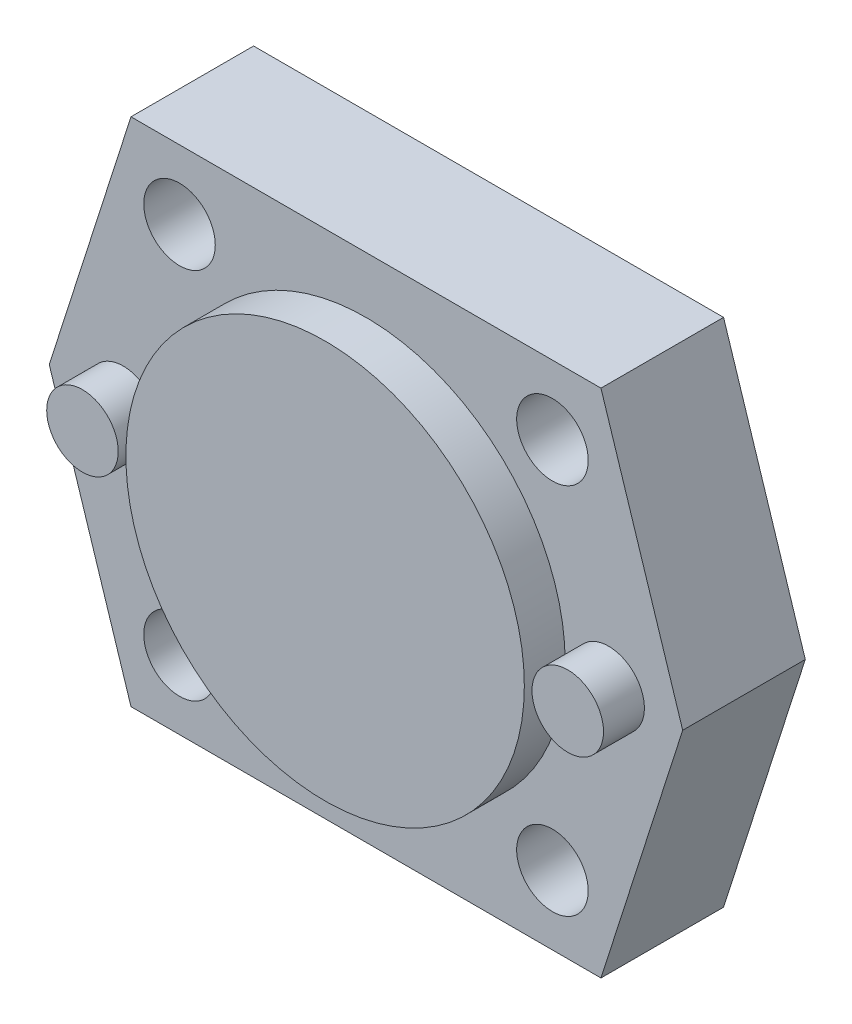
ISO-10303-21;
HEADER;
FILE_DESCRIPTION(('STEP AP214'),'2;1');
FILE_NAME('part.step','',(''),(''),'','','');
FILE_SCHEMA(('AUTOMOTIVE_DESIGN { 1 0 10303 214 1 1 1 1 }'));
ENDSEC;
DATA;
#1=APPLICATION_CONTEXT('core data for automotive mechanical design processes');
#2=APPLICATION_PROTOCOL_DEFINITION('international standard','automotive_design',2000,#1);
#3=PRODUCT_CONTEXT('',#1,'mechanical');
#4=PRODUCT('Part','Part','',(#3));
#5=PRODUCT_RELATED_PRODUCT_CATEGORY('part','',(#4));
#6=PRODUCT_DEFINITION_FORMATION('','',#4);
#7=PRODUCT_DEFINITION_CONTEXT('part definition',#1,'design');
#8=PRODUCT_DEFINITION('design','',#6,#7);
#9=PRODUCT_DEFINITION_SHAPE('','',#8);
#10=(LENGTH_UNIT() NAMED_UNIT(*) SI_UNIT(.MILLI.,.METRE.));
#11=(NAMED_UNIT(*) PLANE_ANGLE_UNIT() SI_UNIT($,.RADIAN.));
#12=(NAMED_UNIT(*) SI_UNIT($,.STERADIAN.) SOLID_ANGLE_UNIT());
#13=UNCERTAINTY_MEASURE_WITH_UNIT(LENGTH_MEASURE(1.E-05),#10,'distance_accuracy_value','');
#14=(GEOMETRIC_REPRESENTATION_CONTEXT(3) GLOBAL_UNCERTAINTY_ASSIGNED_CONTEXT((#13)) GLOBAL_UNIT_ASSIGNED_CONTEXT((#10,
#11,#12)) REPRESENTATION_CONTEXT('',''));
#15=CARTESIAN_POINT('',(0.,0.,0.));
#16=DIRECTION('',(0.,0.,1.));
#17=DIRECTION('',(1.,0.,0.));
#18=AXIS2_PLACEMENT_3D('',#15,#16,#17);
#19=CARTESIAN_POINT('',(-31.,0.,12.));
#20=DIRECTION('',(0.952424147199324,-0.304775727103784,0.));
#21=DIRECTION('',(0.304775727103784,0.952424147199324,0.));
#22=AXIS2_PLACEMENT_3D('',#19,#20,#21);
#23=PLANE('',#22);
#24=DIRECTION('',(-0.304775727103784,-0.952424147199324,0.));
#25=VECTOR('',#24,1.);
#26=CARTESIAN_POINT('',(-31.,0.,0.));
#27=LINE('',#26,#25);
#28=CARTESIAN_POINT('',(-23.,25.,0.));
#29=VERTEX_POINT('',#28);
#30=CARTESIAN_POINT('',(-31.,0.,0.));
#31=VERTEX_POINT('',#30);
#32=EDGE_CURVE('E120',#29,#31,#27,.T.);
#33=ORIENTED_EDGE('',*,*,#32,.T.);
#34=DIRECTION('',(0.,0.,-1.));
#35=VECTOR('',#34,1.);
#36=CARTESIAN_POINT('',(-31.,0.,12.));
#37=LINE('',#36,#35);
#38=CARTESIAN_POINT('',(-31.,0.,12.));
#39=VERTEX_POINT('',#38);
#40=EDGE_CURVE('E138',#39,#31,#37,.T.);
#41=ORIENTED_EDGE('',*,*,#40,.F.);
#42=DIRECTION('',(-0.304775727103784,-0.952424147199324,0.));
#43=VECTOR('',#42,1.);
#44=CARTESIAN_POINT('',(-31.,0.,12.));
#45=LINE('',#44,#43);
#46=CARTESIAN_POINT('',(-23.,25.,12.));
#47=VERTEX_POINT('',#46);
#48=EDGE_CURVE('E131',#47,#39,#45,.T.);
#49=ORIENTED_EDGE('',*,*,#48,.F.);
#50=DIRECTION('',(0.,0.,-1.));
#51=VECTOR('',#50,1.);
#52=CARTESIAN_POINT('',(-23.,25.,12.));
#53=LINE('',#52,#51);
#54=EDGE_CURVE('E116',#47,#29,#53,.T.);
#55=ORIENTED_EDGE('',*,*,#54,.T.);
#56=EDGE_LOOP('',(#33,#41,#49,#55));
#57=FACE_BOUND('',#56,.T.);
#58=ADVANCED_FACE('F35',(#57),#23,.F.);
#59=CARTESIAN_POINT('',(-23.,-25.,12.));
#60=DIRECTION('',(0.952424147199324,0.304775727103784,0.));
#61=DIRECTION('',(-0.304775727103784,0.952424147199324,0.));
#62=AXIS2_PLACEMENT_3D('',#59,#60,#61);
#63=PLANE('',#62);
#64=DIRECTION('',(0.304775727103784,-0.952424147199324,0.));
#65=VECTOR('',#64,1.);
#66=CARTESIAN_POINT('',(-23.,-25.,0.));
#67=LINE('',#66,#65);
#68=CARTESIAN_POINT('',(-23.,-25.,0.));
#69=VERTEX_POINT('',#68);
#70=EDGE_CURVE('E123',#31,#69,#67,.T.);
#71=ORIENTED_EDGE('',*,*,#70,.T.);
#72=DIRECTION('',(0.,0.,-1.));
#73=VECTOR('',#72,1.);
#74=CARTESIAN_POINT('',(-23.,-25.,12.));
#75=LINE('',#74,#73);
#76=CARTESIAN_POINT('',(-23.,-25.,12.));
#77=VERTEX_POINT('',#76);
#78=EDGE_CURVE('E135',#77,#69,#75,.T.);
#79=ORIENTED_EDGE('',*,*,#78,.F.);
#80=DIRECTION('',(0.304775727103784,-0.952424147199324,0.));
#81=VECTOR('',#80,1.);
#82=CARTESIAN_POINT('',(-23.,-25.,12.));
#83=LINE('',#82,#81);
#84=EDGE_CURVE('E89',#39,#77,#83,.T.);
#85=ORIENTED_EDGE('',*,*,#84,.F.);
#86=ORIENTED_EDGE('',*,*,#40,.T.);
#87=EDGE_LOOP('',(#71,#79,#85,#86));
#88=FACE_BOUND('',#87,.T.);
#89=ADVANCED_FACE('F153',(#88),#63,.F.);
#90=CARTESIAN_POINT('',(23.,-25.,12.));
#91=DIRECTION('',(0.,1.,0.));
#92=DIRECTION('',(0.,0.,1.));
#93=AXIS2_PLACEMENT_3D('',#90,#91,#92);
#94=PLANE('',#93);
#95=DIRECTION('',(1.,0.,0.));
#96=VECTOR('',#95,1.);
#97=CARTESIAN_POINT('',(23.,-25.,0.));
#98=LINE('',#97,#96);
#99=CARTESIAN_POINT('',(23.,-25.,0.));
#100=VERTEX_POINT('',#99);
#101=EDGE_CURVE('E126',#69,#100,#98,.T.);
#102=ORIENTED_EDGE('',*,*,#101,.T.);
#103=DIRECTION('',(0.,0.,-1.));
#104=VECTOR('',#103,1.);
#105=CARTESIAN_POINT('',(23.,-25.,12.));
#106=LINE('',#105,#104);
#107=CARTESIAN_POINT('',(23.,-25.,12.));
#108=VERTEX_POINT('',#107);
#109=EDGE_CURVE('E111',#108,#100,#106,.T.);
#110=ORIENTED_EDGE('',*,*,#109,.F.);
#111=DIRECTION('',(1.,0.,0.));
#112=VECTOR('',#111,1.);
#113=CARTESIAN_POINT('',(23.,-25.,12.));
#114=LINE('',#113,#112);
#115=EDGE_CURVE('E102',#77,#108,#114,.T.);
#116=ORIENTED_EDGE('',*,*,#115,.F.);
#117=ORIENTED_EDGE('',*,*,#78,.T.);
#118=EDGE_LOOP('',(#102,#110,#116,#117));
#119=FACE_BOUND('',#118,.T.);
#120=ADVANCED_FACE('F156',(#119),#94,.F.);
#121=CARTESIAN_POINT('',(31.,0.,12.));
#122=DIRECTION('',(-0.952424147199324,0.304775727103784,0.));
#123=DIRECTION('',(-0.304775727103784,-0.952424147199324,0.));
#124=AXIS2_PLACEMENT_3D('',#121,#122,#123);
#125=PLANE('',#124);
#126=DIRECTION('',(0.304775727103784,0.952424147199324,0.));
#127=VECTOR('',#126,1.);
#128=CARTESIAN_POINT('',(31.,0.,0.));
#129=LINE('',#128,#127);
#130=CARTESIAN_POINT('',(31.,0.,0.));
#131=VERTEX_POINT('',#130);
#132=EDGE_CURVE('E110',#100,#131,#129,.T.);
#133=ORIENTED_EDGE('',*,*,#132,.T.);
#134=DIRECTION('',(0.,0.,-1.));
#135=VECTOR('',#134,1.);
#136=CARTESIAN_POINT('',(31.,0.,12.));
#137=LINE('',#136,#135);
#138=CARTESIAN_POINT('',(31.,0.,12.));
#139=VERTEX_POINT('',#138);
#140=EDGE_CURVE('E107',#139,#131,#137,.T.);
#141=ORIENTED_EDGE('',*,*,#140,.F.);
#142=DIRECTION('',(0.304775727103784,0.952424147199324,0.));
#143=VECTOR('',#142,1.);
#144=CARTESIAN_POINT('',(31.,0.,12.));
#145=LINE('',#144,#143);
#146=EDGE_CURVE('E96',#108,#139,#145,.T.);
#147=ORIENTED_EDGE('',*,*,#146,.F.);
#148=ORIENTED_EDGE('',*,*,#109,.T.);
#149=EDGE_LOOP('',(#133,#141,#147,#148));
#150=FACE_BOUND('',#149,.T.);
#151=ADVANCED_FACE('F108',(#150),#125,.F.);
#152=CARTESIAN_POINT('',(23.,25.,12.));
#153=DIRECTION('',(-0.952424147199324,-0.304775727103784,0.));
#154=DIRECTION('',(0.304775727103784,-0.952424147199324,0.));
#155=AXIS2_PLACEMENT_3D('',#152,#153,#154);
#156=PLANE('',#155);
#157=DIRECTION('',(-0.304775727103784,0.952424147199324,0.));
#158=VECTOR('',#157,1.);
#159=CARTESIAN_POINT('',(23.,25.,0.));
#160=LINE('',#159,#158);
#161=CARTESIAN_POINT('',(23.,25.,0.));
#162=VERTEX_POINT('',#161);
#163=EDGE_CURVE('E74',#131,#162,#160,.T.);
#164=ORIENTED_EDGE('',*,*,#163,.T.);
#165=DIRECTION('',(0.,0.,-1.));
#166=VECTOR('',#165,1.);
#167=CARTESIAN_POINT('',(23.,25.,12.));
#168=LINE('',#167,#166);
#169=CARTESIAN_POINT('',(23.,25.,12.));
#170=VERTEX_POINT('',#169);
#171=EDGE_CURVE('E112',#170,#162,#168,.T.);
#172=ORIENTED_EDGE('',*,*,#171,.F.);
#173=DIRECTION('',(-0.304775727103784,0.952424147199324,0.));
#174=VECTOR('',#173,1.);
#175=CARTESIAN_POINT('',(23.,25.,12.));
#176=LINE('',#175,#174);
#177=EDGE_CURVE('E100',#139,#170,#176,.T.);
#178=ORIENTED_EDGE('',*,*,#177,.F.);
#179=ORIENTED_EDGE('',*,*,#140,.T.);
#180=EDGE_LOOP('',(#164,#172,#178,#179));
#181=FACE_BOUND('',#180,.T.);
#182=ADVANCED_FACE('F114',(#181),#156,.F.);
#183=CARTESIAN_POINT('',(-23.,25.,12.));
#184=DIRECTION('',(0.,-1.,0.));
#185=DIRECTION('',(0.,0.,-1.));
#186=AXIS2_PLACEMENT_3D('',#183,#184,#185);
#187=PLANE('',#186);
#188=DIRECTION('',(-1.,0.,0.));
#189=VECTOR('',#188,1.);
#190=CARTESIAN_POINT('',(-23.,25.,0.));
#191=LINE('',#190,#189);
#192=EDGE_CURVE('E80',#162,#29,#191,.T.);
#193=ORIENTED_EDGE('',*,*,#192,.T.);
#194=ORIENTED_EDGE('',*,*,#54,.F.);
#195=DIRECTION('',(-1.,0.,0.));
#196=VECTOR('',#195,1.);
#197=CARTESIAN_POINT('',(-23.,25.,12.));
#198=LINE('',#197,#196);
#199=EDGE_CURVE('E51',#170,#47,#198,.T.);
#200=ORIENTED_EDGE('',*,*,#199,.F.);
#201=ORIENTED_EDGE('',*,*,#171,.T.);
#202=EDGE_LOOP('',(#193,#194,#200,#201));
#203=FACE_BOUND('',#202,.T.);
#204=ADVANCED_FACE('F161',(#203),#187,.F.);
#205=CARTESIAN_POINT('',(0.,0.,12.));
#206=DIRECTION('',(0.,0.,-1.));
#207=DIRECTION('',(-1.,0.,0.));
#208=AXIS2_PLACEMENT_3D('',#205,#206,#207);
#209=PLANE('',#208);
#210=CARTESIAN_POINT('',(-18.25,18.25,12.));
#211=DIRECTION('',(0.,0.,1.));
#212=DIRECTION('',(1.,0.,0.));
#213=AXIS2_PLACEMENT_3D('',#210,#211,#212);
#214=CIRCLE('',#213,3.5);
#215=CARTESIAN_POINT('',(-14.75,18.25,12.));
#216=VERTEX_POINT('',#215);
#217=EDGE_CURVE('E318',#216,#216,#214,.T.);
#218=ORIENTED_EDGE('',*,*,#217,.F.);
#219=EDGE_LOOP('',(#218));
#220=FACE_BOUND('',#219,.T.);
#221=CARTESIAN_POINT('',(-18.25,-18.25,12.));
#222=DIRECTION('',(0.,0.,1.));
#223=DIRECTION('',(1.,0.,0.));
#224=AXIS2_PLACEMENT_3D('',#221,#222,#223);
#225=CIRCLE('',#224,3.5);
#226=CARTESIAN_POINT('',(-14.75,-18.25,12.));
#227=VERTEX_POINT('',#226);
#228=EDGE_CURVE('E320',#227,#227,#225,.T.);
#229=ORIENTED_EDGE('',*,*,#228,.F.);
#230=EDGE_LOOP('',(#229));
#231=FACE_BOUND('',#230,.T.);
#232=CARTESIAN_POINT('',(18.25,-18.25,12.));
#233=DIRECTION('',(0.,0.,1.));
#234=DIRECTION('',(1.,0.,0.));
#235=AXIS2_PLACEMENT_3D('',#232,#233,#234);
#236=CIRCLE('',#235,3.5);
#237=CARTESIAN_POINT('',(21.75,-18.25,12.));
#238=VERTEX_POINT('',#237);
#239=EDGE_CURVE('E347',#238,#238,#236,.T.);
#240=ORIENTED_EDGE('',*,*,#239,.F.);
#241=EDGE_LOOP('',(#240));
#242=FACE_BOUND('',#241,.T.);
#243=CARTESIAN_POINT('',(18.25,18.25,12.));
#244=DIRECTION('',(0.,0.,1.));
#245=DIRECTION('',(1.,0.,0.));
#246=AXIS2_PLACEMENT_3D('',#243,#244,#245);
#247=CIRCLE('',#246,3.5);
#248=CARTESIAN_POINT('',(21.75,18.25,12.));
#249=VERTEX_POINT('',#248);
#250=EDGE_CURVE('E328',#249,#249,#247,.T.);
#251=ORIENTED_EDGE('',*,*,#250,.F.);
#252=EDGE_LOOP('',(#251));
#253=FACE_BOUND('',#252,.T.);
#254=CARTESIAN_POINT('',(-23.75,0.,12.));
#255=DIRECTION('',(0.,0.,-1.));
#256=DIRECTION('',(-1.,0.,0.));
#257=AXIS2_PLACEMENT_3D('',#254,#255,#256);
#258=CIRCLE('',#257,3.5);
#259=CARTESIAN_POINT('',(-27.25,0.,12.));
#260=VERTEX_POINT('',#259);
#261=EDGE_CURVE('E11',#260,#260,#258,.F.);
#262=ORIENTED_EDGE('',*,*,#261,.F.);
#263=EDGE_LOOP('',(#262));
#264=FACE_BOUND('',#263,.T.);
#265=CARTESIAN_POINT('',(23.75,0.,12.));
#266=DIRECTION('',(0.,0.,-1.));
#267=DIRECTION('',(-1.,0.,0.));
#268=AXIS2_PLACEMENT_3D('',#265,#266,#267);
#269=CIRCLE('',#268,3.5);
#270=CARTESIAN_POINT('',(20.25,0.,12.));
#271=VERTEX_POINT('',#270);
#272=EDGE_CURVE('E43',#271,#271,#269,.F.);
#273=ORIENTED_EDGE('',*,*,#272,.F.);
#274=EDGE_LOOP('',(#273));
#275=FACE_BOUND('',#274,.T.);
#276=CARTESIAN_POINT('',(0.,0.,12.));
#277=DIRECTION('',(0.,0.,1.));
#278=DIRECTION('',(1.,0.,0.));
#279=AXIS2_PLACEMENT_3D('',#276,#277,#278);
#280=CIRCLE('',#279,19.5);
#281=CARTESIAN_POINT('',(19.5,0.,12.));
#282=VERTEX_POINT('',#281);
#283=EDGE_CURVE('E139',#282,#282,#280,.T.);
#284=ORIENTED_EDGE('',*,*,#283,.F.);
#285=EDGE_LOOP('',(#284));
#286=FACE_BOUND('',#285,.T.);
#287=ORIENTED_EDGE('',*,*,#48,.T.);
#288=ORIENTED_EDGE('',*,*,#84,.T.);
#289=ORIENTED_EDGE('',*,*,#115,.T.);
#290=ORIENTED_EDGE('',*,*,#146,.T.);
#291=ORIENTED_EDGE('',*,*,#177,.T.);
#292=ORIENTED_EDGE('',*,*,#199,.T.);
#293=EDGE_LOOP('',(#287,#288,#289,#290,#291,#292));
#294=FACE_BOUND('',#293,.T.);
#295=ADVANCED_FACE('F98',(#220,#231,#242,#253,#264,#275,#286,#294),#209,.F.);
#296=CARTESIAN_POINT('',(0.,0.,0.));
#297=DIRECTION('',(0.,0.,-1.));
#298=DIRECTION('',(-1.,0.,0.));
#299=AXIS2_PLACEMENT_3D('',#296,#297,#298);
#300=PLANE('',#299);
#301=CARTESIAN_POINT('',(-18.25,18.25,0.));
#302=DIRECTION('',(0.,0.,1.));
#303=DIRECTION('',(1.,0.,0.));
#304=AXIS2_PLACEMENT_3D('',#301,#302,#303);
#305=CIRCLE('',#304,3.5);
#306=CARTESIAN_POINT('',(-14.75,18.25,0.));
#307=VERTEX_POINT('',#306);
#308=EDGE_CURVE('E315',#307,#307,#305,.T.);
#309=ORIENTED_EDGE('',*,*,#308,.T.);
#310=EDGE_LOOP('',(#309));
#311=FACE_BOUND('',#310,.T.);
#312=CARTESIAN_POINT('',(-18.25,-18.25,0.));
#313=DIRECTION('',(0.,0.,1.));
#314=DIRECTION('',(1.,0.,0.));
#315=AXIS2_PLACEMENT_3D('',#312,#313,#314);
#316=CIRCLE('',#315,3.5);
#317=CARTESIAN_POINT('',(-14.75,-18.25,0.));
#318=VERTEX_POINT('',#317);
#319=EDGE_CURVE('E352',#318,#318,#316,.T.);
#320=ORIENTED_EDGE('',*,*,#319,.T.);
#321=EDGE_LOOP('',(#320));
#322=FACE_BOUND('',#321,.T.);
#323=CARTESIAN_POINT('',(18.25,-18.25,0.));
#324=DIRECTION('',(0.,0.,1.));
#325=DIRECTION('',(1.,0.,0.));
#326=AXIS2_PLACEMENT_3D('',#323,#324,#325);
#327=CIRCLE('',#326,3.5);
#328=CARTESIAN_POINT('',(21.75,-18.25,0.));
#329=VERTEX_POINT('',#328);
#330=EDGE_CURVE('E331',#329,#329,#327,.T.);
#331=ORIENTED_EDGE('',*,*,#330,.T.);
#332=EDGE_LOOP('',(#331));
#333=FACE_BOUND('',#332,.T.);
#334=CARTESIAN_POINT('',(18.25,18.25,0.));
#335=DIRECTION('',(0.,0.,1.));
#336=DIRECTION('',(1.,0.,0.));
#337=AXIS2_PLACEMENT_3D('',#334,#335,#336);
#338=CIRCLE('',#337,3.5);
#339=CARTESIAN_POINT('',(21.75,18.25,0.));
#340=VERTEX_POINT('',#339);
#341=EDGE_CURVE('E324',#340,#340,#338,.T.);
#342=ORIENTED_EDGE('',*,*,#341,.T.);
#343=EDGE_LOOP('',(#342));
#344=FACE_BOUND('',#343,.T.);
#345=ORIENTED_EDGE('',*,*,#32,.F.);
#346=ORIENTED_EDGE('',*,*,#192,.F.);
#347=ORIENTED_EDGE('',*,*,#163,.F.);
#348=ORIENTED_EDGE('',*,*,#132,.F.);
#349=ORIENTED_EDGE('',*,*,#101,.F.);
#350=ORIENTED_EDGE('',*,*,#70,.F.);
#351=EDGE_LOOP('',(#345,#346,#347,#348,#349,#350));
#352=FACE_BOUND('',#351,.T.);
#353=ADVANCED_FACE('F159',(#311,#322,#333,#344,#352),#300,.T.);
#354=CARTESIAN_POINT('',(0.,0.,16.));
#355=DIRECTION('',(0.,0.,-1.));
#356=DIRECTION('',(-1.,0.,0.));
#357=AXIS2_PLACEMENT_3D('',#354,#355,#356);
#358=CYLINDRICAL_SURFACE('',#357,19.5);
#359=CARTESIAN_POINT('',(0.,0.,16.));
#360=DIRECTION('',(0.,0.,1.));
#361=DIRECTION('',(1.,0.,0.));
#362=AXIS2_PLACEMENT_3D('',#359,#360,#361);
#363=CIRCLE('',#362,19.5);
#364=CARTESIAN_POINT('',(19.5,0.,16.));
#365=VERTEX_POINT('',#364);
#366=EDGE_CURVE('E124',#365,#365,#363,.T.);
#367=ORIENTED_EDGE('',*,*,#366,.F.);
#368=EDGE_LOOP('',(#367));
#369=FACE_BOUND('',#368,.T.);
#370=ORIENTED_EDGE('',*,*,#283,.T.);
#371=EDGE_LOOP('',(#370));
#372=FACE_BOUND('',#371,.T.);
#373=ADVANCED_FACE('F200',(#369,#372),#358,.T.);
#374=CARTESIAN_POINT('',(0.,0.,16.));
#375=DIRECTION('',(0.,0.,1.));
#376=DIRECTION('',(1.,0.,0.));
#377=AXIS2_PLACEMENT_3D('',#374,#375,#376);
#378=PLANE('',#377);
#379=ORIENTED_EDGE('',*,*,#366,.T.);
#380=EDGE_LOOP('',(#379));
#381=FACE_BOUND('',#380,.T.);
#382=ADVANCED_FACE('F205',(#381),#378,.T.);
#383=CARTESIAN_POINT('',(23.75,0.,16.));
#384=DIRECTION('',(0.,0.,-1.));
#385=DIRECTION('',(-1.,0.,0.));
#386=AXIS2_PLACEMENT_3D('',#383,#384,#385);
#387=CYLINDRICAL_SURFACE('',#386,3.5);
#388=CARTESIAN_POINT('',(23.75,0.,16.));
#389=DIRECTION('',(0.,0.,1.));
#390=DIRECTION('',(1.,0.,0.));
#391=AXIS2_PLACEMENT_3D('',#388,#389,#390);
#392=CIRCLE('',#391,3.5);
#393=CARTESIAN_POINT('',(27.25,0.,16.));
#394=VERTEX_POINT('',#393);
#395=EDGE_CURVE('E333',#394,#394,#392,.T.);
#396=ORIENTED_EDGE('',*,*,#395,.F.);
#397=EDGE_LOOP('',(#396));
#398=FACE_BOUND('',#397,.T.);
#399=ORIENTED_EDGE('',*,*,#272,.T.);
#400=EDGE_LOOP('',(#399));
#401=FACE_BOUND('',#400,.T.);
#402=ADVANCED_FACE('F217',(#398,#401),#387,.T.);
#403=CARTESIAN_POINT('',(23.75,0.,16.));
#404=DIRECTION('',(0.,0.,1.));
#405=DIRECTION('',(1.,0.,0.));
#406=AXIS2_PLACEMENT_3D('',#403,#404,#405);
#407=PLANE('',#406);
#408=ORIENTED_EDGE('',*,*,#395,.T.);
#409=EDGE_LOOP('',(#408));
#410=FACE_BOUND('',#409,.T.);
#411=ADVANCED_FACE('F227',(#410),#407,.T.);
#412=CARTESIAN_POINT('',(-23.75,0.,16.));
#413=DIRECTION('',(0.,0.,-1.));
#414=DIRECTION('',(-1.,0.,0.));
#415=AXIS2_PLACEMENT_3D('',#412,#413,#414);
#416=CYLINDRICAL_SURFACE('',#415,3.5);
#417=CARTESIAN_POINT('',(-23.75,0.,16.));
#418=DIRECTION('',(0.,0.,1.));
#419=DIRECTION('',(1.,0.,0.));
#420=AXIS2_PLACEMENT_3D('',#417,#418,#419);
#421=CIRCLE('',#420,3.5);
#422=CARTESIAN_POINT('',(-20.25,0.,16.));
#423=VERTEX_POINT('',#422);
#424=EDGE_CURVE('E327',#423,#423,#421,.T.);
#425=ORIENTED_EDGE('',*,*,#424,.F.);
#426=EDGE_LOOP('',(#425));
#427=FACE_BOUND('',#426,.T.);
#428=ORIENTED_EDGE('',*,*,#261,.T.);
#429=EDGE_LOOP('',(#428));
#430=FACE_BOUND('',#429,.T.);
#431=ADVANCED_FACE('F237',(#427,#430),#416,.T.);
#432=CARTESIAN_POINT('',(-23.75,0.,16.));
#433=DIRECTION('',(0.,0.,1.));
#434=DIRECTION('',(1.,0.,0.));
#435=AXIS2_PLACEMENT_3D('',#432,#433,#434);
#436=PLANE('',#435);
#437=ORIENTED_EDGE('',*,*,#424,.T.);
#438=EDGE_LOOP('',(#437));
#439=FACE_BOUND('',#438,.T.);
#440=ADVANCED_FACE('F247',(#439),#436,.T.);
#441=CARTESIAN_POINT('',(18.25,18.25,0.));
#442=DIRECTION('',(0.,0.,1.));
#443=DIRECTION('',(1.,0.,0.));
#444=AXIS2_PLACEMENT_3D('',#441,#442,#443);
#445=CYLINDRICAL_SURFACE('',#444,3.5);
#446=ORIENTED_EDGE('',*,*,#341,.F.);
#447=EDGE_LOOP('',(#446));
#448=FACE_BOUND('',#447,.T.);
#449=ORIENTED_EDGE('',*,*,#250,.T.);
#450=EDGE_LOOP('',(#449));
#451=FACE_BOUND('',#450,.T.);
#452=ADVANCED_FACE('F257',(#448,#451),#445,.F.);
#453=CARTESIAN_POINT('',(18.25,-18.25,0.));
#454=DIRECTION('',(0.,0.,1.));
#455=DIRECTION('',(1.,0.,0.));
#456=AXIS2_PLACEMENT_3D('',#453,#454,#455);
#457=CYLINDRICAL_SURFACE('',#456,3.5);
#458=ORIENTED_EDGE('',*,*,#330,.F.);
#459=EDGE_LOOP('',(#458));
#460=FACE_BOUND('',#459,.T.);
#461=ORIENTED_EDGE('',*,*,#239,.T.);
#462=EDGE_LOOP('',(#461));
#463=FACE_BOUND('',#462,.T.);
#464=ADVANCED_FACE('F278',(#460,#463),#457,.F.);
#465=CARTESIAN_POINT('',(-18.25,-18.25,0.));
#466=DIRECTION('',(0.,0.,1.));
#467=DIRECTION('',(1.,0.,0.));
#468=AXIS2_PLACEMENT_3D('',#465,#466,#467);
#469=CYLINDRICAL_SURFACE('',#468,3.5);
#470=ORIENTED_EDGE('',*,*,#319,.F.);
#471=EDGE_LOOP('',(#470));
#472=FACE_BOUND('',#471,.T.);
#473=ORIENTED_EDGE('',*,*,#228,.T.);
#474=EDGE_LOOP('',(#473));
#475=FACE_BOUND('',#474,.T.);
#476=ADVANCED_FACE('F288',(#472,#475),#469,.F.);
#477=CARTESIAN_POINT('',(-18.25,18.25,0.));
#478=DIRECTION('',(0.,0.,1.));
#479=DIRECTION('',(1.,0.,0.));
#480=AXIS2_PLACEMENT_3D('',#477,#478,#479);
#481=CYLINDRICAL_SURFACE('',#480,3.5);
#482=ORIENTED_EDGE('',*,*,#308,.F.);
#483=EDGE_LOOP('',(#482));
#484=FACE_BOUND('',#483,.T.);
#485=ORIENTED_EDGE('',*,*,#217,.T.);
#486=EDGE_LOOP('',(#485));
#487=FACE_BOUND('',#486,.T.);
#488=ADVANCED_FACE('F298',(#484,#487),#481,.F.);
#489=CLOSED_SHELL('',(#58,#89,#120,#151,#182,#204,#295,#353,#373,#382,#402,#411,#431,#440,#452,
#464,#476,#488));
#490=MANIFOLD_SOLID_BREP('B2',#489);
#491=ADVANCED_BREP_SHAPE_REPRESENTATION('',(#18,#490),#14);
#492=SHAPE_DEFINITION_REPRESENTATION(#9,#491);
ENDSEC;
END-ISO-10303-21;
